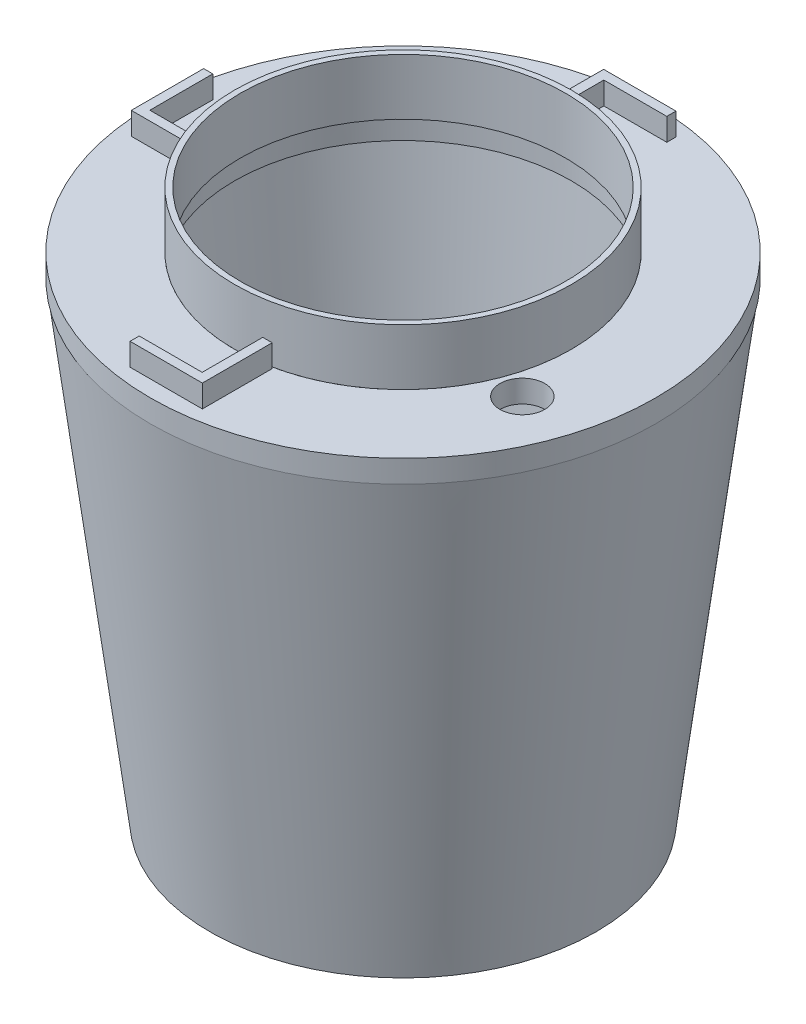
ISO-10303-21;
HEADER;
FILE_DESCRIPTION(('STEP AP214'),'2;1');
FILE_NAME('part.step','',(''),(''),'','','');
FILE_SCHEMA(('AUTOMOTIVE_DESIGN { 1 0 10303 214 1 1 1 1 }'));
ENDSEC;
DATA;
#1=APPLICATION_CONTEXT('core data for automotive mechanical design processes');
#2=APPLICATION_PROTOCOL_DEFINITION('international standard','automotive_design',2000,#1);
#3=PRODUCT_CONTEXT('',#1,'mechanical');
#4=PRODUCT('Part','Part','',(#3));
#5=PRODUCT_RELATED_PRODUCT_CATEGORY('part','',(#4));
#6=PRODUCT_DEFINITION_FORMATION('','',#4);
#7=PRODUCT_DEFINITION_CONTEXT('part definition',#1,'design');
#8=PRODUCT_DEFINITION('design','',#6,#7);
#9=PRODUCT_DEFINITION_SHAPE('','',#8);
#10=(LENGTH_UNIT() NAMED_UNIT(*) SI_UNIT(.MILLI.,.METRE.));
#11=(NAMED_UNIT(*) PLANE_ANGLE_UNIT() SI_UNIT($,.RADIAN.));
#12=(NAMED_UNIT(*) SI_UNIT($,.STERADIAN.) SOLID_ANGLE_UNIT());
#13=UNCERTAINTY_MEASURE_WITH_UNIT(LENGTH_MEASURE(1.E-05),#10,'distance_accuracy_value','');
#14=(GEOMETRIC_REPRESENTATION_CONTEXT(3) GLOBAL_UNCERTAINTY_ASSIGNED_CONTEXT((#13)) GLOBAL_UNIT_ASSIGNED_CONTEXT((#10,
#11,#12)) REPRESENTATION_CONTEXT('',''));
#15=CARTESIAN_POINT('',(0.,0.,0.));
#16=DIRECTION('',(0.,0.,1.));
#17=DIRECTION('',(1.,0.,0.));
#18=AXIS2_PLACEMENT_3D('',#15,#16,#17);
#19=CARTESIAN_POINT('',(8.81748666377419E-13,580.,0.));
#20=DIRECTION('',(0.,1.,0.));
#21=DIRECTION('',(-1.,0.,0.));
#22=AXIS2_PLACEMENT_3D('',#19,#20,#21);
#23=PLANE('',#22);
#24=CARTESIAN_POINT('',(8.81748666377419E-13,580.,0.));
#25=DIRECTION('',(0.,1.,0.));
#26=DIRECTION('',(-1.,0.,0.));
#27=AXIS2_PLACEMENT_3D('',#24,#25,#26);
#28=CIRCLE('',#27,300.);
#29=CARTESIAN_POINT('',(-299.999999999999,580.000000000002,0.));
#30=VERTEX_POINT('',#29);
#31=EDGE_CURVE('E11',#30,#30,#28,.T.);
#32=ORIENTED_EDGE('',*,*,#31,.T.);
#33=EDGE_LOOP('',(#32));
#34=FACE_BOUND('',#33,.T.);
#35=CARTESIAN_POINT('',(8.81748666377419E-13,580.,0.));
#36=DIRECTION('',(0.,1.,0.));
#37=DIRECTION('',(-1.,0.,0.));
#38=AXIS2_PLACEMENT_3D('',#35,#36,#37);
#39=CIRCLE('',#38,290.);
#40=CARTESIAN_POINT('',(-289.999999999999,580.000000000002,0.));
#41=VERTEX_POINT('',#40);
#42=EDGE_CURVE('E60',#41,#41,#39,.T.);
#43=ORIENTED_EDGE('',*,*,#42,.F.);
#44=EDGE_LOOP('',(#43));
#45=FACE_BOUND('',#44,.T.);
#46=ADVANCED_FACE('F49',(#34,#45),#23,.T.);
#47=CARTESIAN_POINT('',(1.83452398608792E-13,480.,0.));
#48=DIRECTION('',(0.,1.,0.));
#49=DIRECTION('',(-1.,0.,0.));
#50=AXIS2_PLACEMENT_3D('',#47,#48,#49);
#51=PLANE('',#50);
#52=CARTESIAN_POINT('',(1.83452398608792E-13,480.,0.));
#53=DIRECTION('',(0.,1.,0.));
#54=DIRECTION('',(-1.,0.,0.));
#55=AXIS2_PLACEMENT_3D('',#52,#53,#54);
#56=CIRCLE('',#55,300.);
#57=CARTESIAN_POINT('',(-300.,480.000000000002,0.));
#58=VERTEX_POINT('',#57);
#59=EDGE_CURVE('E53',#58,#58,#56,.T.);
#60=ORIENTED_EDGE('',*,*,#59,.F.);
#61=EDGE_LOOP('',(#60));
#62=FACE_BOUND('',#61,.T.);
#63=CARTESIAN_POINT('',(1.83452398608792E-13,480.,0.));
#64=DIRECTION('',(0.,1.,0.));
#65=DIRECTION('',(-1.,0.,0.));
#66=AXIS2_PLACEMENT_3D('',#63,#64,#65);
#67=CIRCLE('',#66,290.);
#68=CARTESIAN_POINT('',(-290.,480.000000000002,0.));
#69=VERTEX_POINT('',#68);
#70=EDGE_CURVE('E62',#69,#69,#67,.T.);
#71=ORIENTED_EDGE('',*,*,#70,.T.);
#72=EDGE_LOOP('',(#71));
#73=FACE_BOUND('',#72,.T.);
#74=ADVANCED_FACE('F72',(#62,#73),#51,.F.);
#75=CARTESIAN_POINT('',(8.81748666377419E-13,580.,0.));
#76=DIRECTION('',(0.,-1.,0.));
#77=DIRECTION('',(1.,0.,0.));
#78=AXIS2_PLACEMENT_3D('',#75,#76,#77);
#79=CYLINDRICAL_SURFACE('',#78,300.);
#80=ORIENTED_EDGE('',*,*,#31,.F.);
#81=EDGE_LOOP('',(#80));
#82=FACE_BOUND('',#81,.T.);
#83=ORIENTED_EDGE('',*,*,#59,.T.);
#84=EDGE_LOOP('',(#83));
#85=FACE_BOUND('',#84,.T.);
#86=ADVANCED_FACE('F51',(#82,#85),#79,.T.);
#87=CARTESIAN_POINT('',(8.81748666377419E-13,580.,0.));
#88=DIRECTION('',(0.,-1.,0.));
#89=DIRECTION('',(1.,0.,0.));
#90=AXIS2_PLACEMENT_3D('',#87,#88,#89);
#91=CYLINDRICAL_SURFACE('',#90,290.);
#92=ORIENTED_EDGE('',*,*,#42,.T.);
#93=EDGE_LOOP('',(#92));
#94=FACE_BOUND('',#93,.T.);
#95=ORIENTED_EDGE('',*,*,#70,.F.);
#96=EDGE_LOOP('',(#95));
#97=FACE_BOUND('',#96,.T.);
#98=ADVANCED_FACE('F68',(#94,#97),#91,.F.);
#99=CLOSED_SHELL('',(#46,#74,#86,#98));
#100=MANIFOLD_SOLID_BREP('B2',#99);
#101=CARTESIAN_POINT('',(1.83452398608792E-13,480.,0.));
#102=DIRECTION('',(0.,-1.,0.));
#103=DIRECTION('',(1.,0.,0.));
#104=AXIS2_PLACEMENT_3D('',#101,#102,#103);
#105=PLANE('',#104);
#106=CARTESIAN_POINT('',(1.83452398608792E-13,480.,0.));
#107=DIRECTION('',(0.,-1.,0.));
#108=DIRECTION('',(1.,0.,0.));
#109=AXIS2_PLACEMENT_3D('',#106,#107,#108);
#110=CIRCLE('',#109,449.9135991914);
#111=CARTESIAN_POINT('',(449.9135991914,479.999999999997,0.));
#112=VERTEX_POINT('',#111);
#113=EDGE_CURVE('E437',#112,#112,#110,.T.);
#114=ORIENTED_EDGE('',*,*,#113,.F.);
#115=EDGE_LOOP('',(#114));
#116=FACE_BOUND('',#115,.T.);
#117=CARTESIAN_POINT('',(329.,479.999999999998,116.390796003985));
#118=DIRECTION('',(0.,-1.,0.));
#119=DIRECTION('',(1.,0.,0.));
#120=AXIS2_PLACEMENT_3D('',#117,#118,#119);
#121=CIRCLE('',#120,40.);
#122=CARTESIAN_POINT('',(369.,479.999999999997,116.390796003985));
#123=VERTEX_POINT('',#122);
#124=EDGE_CURVE('E418',#123,#123,#121,.F.);
#125=ORIENTED_EDGE('',*,*,#124,.F.);
#126=EDGE_LOOP('',(#125));
#127=FACE_BOUND('',#126,.T.);
#128=DIRECTION('',(1.,0.,0.));
#129=VECTOR('',#128,1.);
#130=CARTESIAN_POINT('',(-65.5608926281112,480.,420.64042064597));
#131=LINE('',#130,#129);
#132=CARTESIAN_POINT('',(-65.5608926281112,480.,420.64042064597));
#133=VERTEX_POINT('',#132);
#134=CARTESIAN_POINT('',(63.3002574758802,480.,420.64042064597));
#135=VERTEX_POINT('',#134);
#136=EDGE_CURVE('E272',#133,#135,#131,.T.);
#137=ORIENTED_EDGE('',*,*,#136,.F.);
#138=DIRECTION('',(0.,0.,1.));
#139=VECTOR('',#138,1.);
#140=CARTESIAN_POINT('',(-65.5608926281112,480.,420.64042064597));
#141=LINE('',#140,#139);
#142=CARTESIAN_POINT('',(-65.5608926281112,480.,404.304870329621));
#143=VERTEX_POINT('',#142);
#144=EDGE_CURVE('E269',#143,#133,#141,.T.);
#145=ORIENTED_EDGE('',*,*,#144,.F.);
#146=DIRECTION('',(-1.,0.,0.));
#147=VECTOR('',#146,1.);
#148=CARTESIAN_POINT('',(-65.5608926281112,480.,404.304870329621));
#149=LINE('',#148,#147);
#150=CARTESIAN_POINT('',(46.5935386275027,480.,404.304870329621));
#151=VERTEX_POINT('',#150);
#152=EDGE_CURVE('E828',#151,#143,#149,.T.);
#153=ORIENTED_EDGE('',*,*,#152,.F.);
#154=DIRECTION('',(0.,0.,1.));
#155=VECTOR('',#154,1.);
#156=CARTESIAN_POINT('',(46.5935386275024,480.,299.999999999984));
#157=LINE('',#156,#155);
#158=CARTESIAN_POINT('',(46.5935386275024,480.,296.359650016947));
#159=VERTEX_POINT('',#158);
#160=EDGE_CURVE('E848',#159,#151,#157,.T.);
#161=ORIENTED_EDGE('',*,*,#160,.F.);
#162=CARTESIAN_POINT('',(1.83452398608792E-13,480.,0.));
#163=DIRECTION('',(0.,-1.,0.));
#164=DIRECTION('',(1.,0.,0.));
#165=AXIS2_PLACEMENT_3D('',#162,#163,#164);
#166=CIRCLE('',#165,300.);
#167=CARTESIAN_POINT('',(-296.359650016952,480.000000000002,46.5935386274721));
#168=VERTEX_POINT('',#167);
#169=EDGE_CURVE('E433',#159,#168,#166,.T.);
#170=ORIENTED_EDGE('',*,*,#169,.T.);
#171=DIRECTION('',(0.,0.,-1.));
#172=VECTOR('',#171,1.);
#173=CARTESIAN_POINT('',(-296.359650016952,480.000000000002,46.593538627472));
#174=LINE('',#173,#172);
#175=CARTESIAN_POINT('',(-296.359650016952,480.000000000002,63.3002574758497));
#176=VERTEX_POINT('',#175);
#177=EDGE_CURVE('E380',#176,#168,#174,.T.);
#178=ORIENTED_EDGE('',*,*,#177,.F.);
#179=DIRECTION('',(1.,0.,0.));
#180=VECTOR('',#179,1.);
#181=CARTESIAN_POINT('',(-296.359650016952,480.000000000002,63.3002574758497));
#182=LINE('',#181,#180);
#183=CARTESIAN_POINT('',(-420.640420645986,480.000000000003,63.3002574758497));
#184=VERTEX_POINT('',#183);
#185=EDGE_CURVE('E376',#184,#176,#182,.T.);
#186=ORIENTED_EDGE('',*,*,#185,.F.);
#187=DIRECTION('',(0.,0.,1.));
#188=VECTOR('',#187,1.);
#189=CARTESIAN_POINT('',(-420.640420645986,480.000000000003,-65.5608926281417));
#190=LINE('',#189,#188);
#191=CARTESIAN_POINT('',(-420.640420645986,480.000000000003,-65.5608926281417));
#192=VERTEX_POINT('',#191);
#193=EDGE_CURVE('E372',#192,#184,#190,.T.);
#194=ORIENTED_EDGE('',*,*,#193,.F.);
#195=DIRECTION('',(-1.,0.,0.));
#196=VECTOR('',#195,1.);
#197=CARTESIAN_POINT('',(-420.640420645986,480.000000000003,-65.5608926281417));
#198=LINE('',#197,#196);
#199=CARTESIAN_POINT('',(-404.304870329637,480.000000000003,-65.5608926281417));
#200=VERTEX_POINT('',#199);
#201=EDGE_CURVE('E347',#200,#192,#198,.T.);
#202=ORIENTED_EDGE('',*,*,#201,.F.);
#203=DIRECTION('',(0.,0.,-1.));
#204=VECTOR('',#203,1.);
#205=CARTESIAN_POINT('',(-404.304870329637,480.000000000003,-65.5608926281417));
#206=LINE('',#205,#204);
#207=CARTESIAN_POINT('',(-404.304870329637,480.000000000003,46.593538627472));
#208=VERTEX_POINT('',#207);
#209=EDGE_CURVE('E353',#208,#200,#206,.T.);
#210=ORIENTED_EDGE('',*,*,#209,.F.);
#211=DIRECTION('',(-1.,0.,0.));
#212=VECTOR('',#211,1.);
#213=CARTESIAN_POINT('',(-300.,480.000000000002,46.593538627472));
#214=LINE('',#213,#212);
#215=EDGE_CURVE('E384',#168,#208,#214,.T.);
#216=ORIENTED_EDGE('',*,*,#215,.F.);
#217=CARTESIAN_POINT('',(-46.5935386272798,480.,-296.359650016982));
#218=VERTEX_POINT('',#217);
#219=EDGE_CURVE('E427',#168,#218,#166,.T.);
#220=ORIENTED_EDGE('',*,*,#219,.T.);
#221=DIRECTION('',(1.,0.,0.));
#222=VECTOR('',#221,1.);
#223=CARTESIAN_POINT('',(-46.5935386274875,480.,-296.359650016982));
#224=LINE('',#223,#222);
#225=CARTESIAN_POINT('',(-63.3002574758652,480.,-296.359650016982));
#226=VERTEX_POINT('',#225);
#227=EDGE_CURVE('E309',#226,#218,#224,.T.);
#228=ORIENTED_EDGE('',*,*,#227,.F.);
#229=DIRECTION('',(0.,0.,1.));
#230=VECTOR('',#229,1.);
#231=CARTESIAN_POINT('',(-63.3002574758652,480.,-300.00000000003));
#232=LINE('',#231,#230);
#233=CARTESIAN_POINT('',(-63.3002574758652,480.,-420.640420646016));
#234=VERTEX_POINT('',#233);
#235=EDGE_CURVE('E279',#234,#226,#232,.T.);
#236=ORIENTED_EDGE('',*,*,#235,.F.);
#237=DIRECTION('',(-1.,0.,0.));
#238=VECTOR('',#237,1.);
#239=CARTESIAN_POINT('',(65.5608926281262,480.,-420.640420646016));
#240=LINE('',#239,#238);
#241=CARTESIAN_POINT('',(65.5608926281262,480.,-420.640420646016));
#242=VERTEX_POINT('',#241);
#243=EDGE_CURVE('E274',#242,#234,#240,.T.);
#244=ORIENTED_EDGE('',*,*,#243,.F.);
#245=DIRECTION('',(0.,0.,-1.));
#246=VECTOR('',#245,1.);
#247=CARTESIAN_POINT('',(65.5608926281262,480.,-420.640420646016));
#248=LINE('',#247,#246);
#249=CARTESIAN_POINT('',(65.5608926281262,480.,-404.304870329667));
#250=VERTEX_POINT('',#249);
#251=EDGE_CURVE('E290',#250,#242,#248,.T.);
#252=ORIENTED_EDGE('',*,*,#251,.F.);
#253=DIRECTION('',(1.,0.,0.));
#254=VECTOR('',#253,1.);
#255=CARTESIAN_POINT('',(65.5608926281262,480.,-404.304870329667));
#256=LINE('',#255,#254);
#257=CARTESIAN_POINT('',(-46.5935386274875,480.,-404.304870329667));
#258=VERTEX_POINT('',#257);
#259=EDGE_CURVE('E317',#258,#250,#256,.T.);
#260=ORIENTED_EDGE('',*,*,#259,.F.);
#261=DIRECTION('',(0.,0.,-1.));
#262=VECTOR('',#261,1.);
#263=CARTESIAN_POINT('',(-46.5935386274875,480.,-300.00000000003));
#264=LINE('',#263,#262);
#265=EDGE_CURVE('E313',#218,#258,#264,.T.);
#266=ORIENTED_EDGE('',*,*,#265,.F.);
#267=EDGE_CURVE('E432',#218,#159,#166,.T.);
#268=ORIENTED_EDGE('',*,*,#267,.T.);
#269=DIRECTION('',(-1.,0.,0.));
#270=VECTOR('',#269,1.);
#271=CARTESIAN_POINT('',(46.5935386275024,480.,296.359650016936));
#272=LINE('',#271,#270);
#273=CARTESIAN_POINT('',(63.3002574758805,480.,296.359650016936));
#274=VERTEX_POINT('',#273);
#275=EDGE_CURVE('E138',#274,#159,#272,.T.);
#276=ORIENTED_EDGE('',*,*,#275,.F.);
#277=DIRECTION('',(0.,0.,-1.));
#278=VECTOR('',#277,1.);
#279=CARTESIAN_POINT('',(63.3002574758802,480.,299.999999999984));
#280=LINE('',#279,#278);
#281=EDGE_CURVE('E133',#135,#274,#280,.T.);
#282=ORIENTED_EDGE('',*,*,#281,.F.);
#283=EDGE_LOOP('',(#137,#145,#153,#161,#170,#178,#186,#194,#202,#210,#216,#220,#228,#236,#244,
#252,#260,#266,#268,#276,#282));
#284=FACE_BOUND('',#283,.T.);
#285=ADVANCED_FACE('F111',(#116,#127,#284),#105,.F.);
#286=CARTESIAN_POINT('',(0.,453.634978952027,0.));
#287=DIRECTION('',(0.,1.,0.));
#288=DIRECTION('',(-1.,0.,0.));
#289=AXIS2_PLACEMENT_3D('',#286,#287,#288);
#290=CONICAL_SURFACE('',#289,400.000001225462,0.124354996055023);
#291=CARTESIAN_POINT('',(1.57129351479355E-13,440.,0.));
#292=DIRECTION('',(0.,-1.,0.));
#293=DIRECTION('',(1.,0.,0.));
#294=AXIS2_PLACEMENT_3D('',#291,#292,#293);
#295=CIRCLE('',#294,398.295628835572);
#296=CARTESIAN_POINT('',(398.295628835573,439.999999999997,0.));
#297=VERTEX_POINT('',#296);
#298=EDGE_CURVE('E449',#297,#297,#295,.T.);
#299=ORIENTED_EDGE('',*,*,#298,.F.);
#300=EDGE_LOOP('',(#299));
#301=FACE_BOUND('',#300,.T.);
#302=CARTESIAN_POINT('',(0.,-346.365021047973,0.));
#303=DIRECTION('',(0.,-1.,0.));
#304=DIRECTION('',(1.,0.,0.));
#305=AXIS2_PLACEMENT_3D('',#302,#303,#304);
#306=CIRCLE('',#305,300.);
#307=CARTESIAN_POINT('',(300.,-346.365021047973,0.));
#308=VERTEX_POINT('',#307);
#309=EDGE_CURVE('E441',#308,#308,#306,.T.);
#310=ORIENTED_EDGE('',*,*,#309,.T.);
#311=EDGE_LOOP('',(#310));
#312=FACE_BOUND('',#311,.T.);
#313=CARTESIAN_POINT('',(-8.99081232531317E-13,365.,0.));
#314=DIRECTION('',(0.,-1.,0.));
#315=DIRECTION('',(1.,0.,0.));
#316=AXIS2_PLACEMENT_3D('',#313,#314,#315);
#317=CIRCLE('',#316,388.920628720685);
#318=CARTESIAN_POINT('',(367.420414157752,364.999999999997,127.520565810534));
#319=VERTEX_POINT('',#318);
#320=CARTESIAN_POINT('',(365.872035568714,364.999999999997,131.897342783312));
#321=VERTEX_POINT('',#320);
#322=EDGE_CURVE('E126',#319,#321,#317,.T.);
#323=ORIENTED_EDGE('',*,*,#322,.F.);
#324=CARTESIAN_POINT('',(367.420547725301,364.999799999997,127.520104719614));
#325=CARTESIAN_POINT('',(367.377451100847,365.064380780821,127.668899908256));
#326=CARTESIAN_POINT('',(367.332816942867,365.123435836757,127.819734004511));
#327=CARTESIAN_POINT('',(367.240503232415,365.229314914026,128.124902648682));
#328=CARTESIAN_POINT('',(367.192820570378,365.276126190402,128.279240663814));
#329=CARTESIAN_POINT('',(367.094644324463,365.356105291162,128.590163618304));
#330=CARTESIAN_POINT('',(367.044157586223,365.389304815828,128.746742447927));
#331=CARTESIAN_POINT('',(366.940553698356,365.44127603721,129.061308577041));
#332=CARTESIAN_POINT('',(366.88743763193,365.460053623523,129.219295274898));
#333=CARTESIAN_POINT('',(366.723942381428,365.493825477043,129.695552884951));
#334=CARTESIAN_POINT('',(366.609918293707,365.485837618788,130.014525935467));
#335=CARTESIAN_POINT('',(366.376474992325,365.409527596015,130.642518021559));
#336=CARTESIAN_POINT('',(366.257061158599,365.341264386375,130.951546477838));
#337=CARTESIAN_POINT('',(366.092862439022,365.212496335922,131.361895202446));
#338=CARTESIAN_POINT('',(366.048642293268,365.174388616228,131.470973402926));
#339=CARTESIAN_POINT('',(365.960225074659,365.091770996076,131.686391043563));
#340=CARTESIAN_POINT('',(365.916028148054,365.0472746958,131.792735749754));
#341=CARTESIAN_POINT('',(365.871849469275,364.999799999997,131.897785289951));
#342=B_SPLINE_CURVE_WITH_KNOTS('',3,(#324,#325,#326,#327,#328,#329,#330,#331,#332,#333,#334,
#335,#336,#337,#338,#339,#340,#341),.UNSPECIFIED.,.F.,.F.,(4,2,2,2,2,2,2,2,4),(0.,
0.503502056321572,1.00752615738576,1.51036968099835,2.01300774525483,3.0233820337639,
4.03276917596355,4.40378104023876,4.77401448362806),.UNSPECIFIED.);
#343=EDGE_CURVE('E47',#319,#321,#342,.T.);
#344=ORIENTED_EDGE('',*,*,#343,.T.);
#345=EDGE_LOOP('',(#323,#344));
#346=FACE_BOUND('',#345,.T.);
#347=ADVANCED_FACE('F467',(#301,#312,#346),#290,.F.);
#348=CARTESIAN_POINT('',(344.139110926866,-396.365021123973,0.));
#349=DIRECTION('',(0.,-1.,0.));
#350=DIRECTION('',(1.,0.,0.));
#351=AXIS2_PLACEMENT_3D('',#348,#349,#350);
#352=PLANE('',#351);
#353=CARTESIAN_POINT('',(0.,-396.365021123973,0.));
#354=DIRECTION('',(0.,-1.,0.));
#355=DIRECTION('',(1.,0.,0.));
#356=AXIS2_PLACEMENT_3D('',#353,#354,#355);
#357=CIRCLE('',#356,344.139110926866);
#358=CARTESIAN_POINT('',(344.139110926866,-396.365021123973,0.));
#359=VERTEX_POINT('',#358);
#360=EDGE_CURVE('E453',#359,#359,#357,.T.);
#361=ORIENTED_EDGE('',*,*,#360,.T.);
#362=EDGE_LOOP('',(#361));
#363=FACE_BOUND('',#362,.T.);
#364=ADVANCED_FACE('F469',(#363),#352,.T.);
#365=CARTESIAN_POINT('',(0.,-396.365021123973,0.));
#366=DIRECTION('',(0.,1.,0.));
#367=DIRECTION('',(-1.,0.,0.));
#368=AXIS2_PLACEMENT_3D('',#365,#366,#367);
#369=CONICAL_SURFACE('',#368,344.139110926866,0.124354996055023);
#370=CARTESIAN_POINT('',(1.20852091476542E-11,440.,0.));
#371=DIRECTION('',(0.,-1.,0.));
#372=DIRECTION('',(1.,0.,0.));
#373=AXIS2_PLACEMENT_3D('',#370,#371,#372);
#374=CIRCLE('',#373,448.68473984853);
#375=CARTESIAN_POINT('',(448.684739848542,439.999999999997,0.));
#376=VERTEX_POINT('',#375);
#377=EDGE_CURVE('E445',#376,#376,#374,.F.);
#378=ORIENTED_EDGE('',*,*,#377,.F.);
#379=EDGE_LOOP('',(#378));
#380=FACE_BOUND('',#379,.T.);
#381=ORIENTED_EDGE('',*,*,#360,.F.);
#382=EDGE_LOOP('',(#381));
#383=FACE_BOUND('',#382,.T.);
#384=ADVANCED_FACE('F475',(#380,#383),#369,.T.);
#385=CARTESIAN_POINT('',(0.,440.,0.));
#386=DIRECTION('',(0.,-1.,0.));
#387=DIRECTION('',(1.,0.,0.));
#388=AXIS2_PLACEMENT_3D('',#385,#386,#387);
#389=PLANE('',#388);
#390=CARTESIAN_POINT('',(0.,440.,0.));
#391=DIRECTION('',(0.,-1.,0.));
#392=DIRECTION('',(1.,0.,0.));
#393=AXIS2_PLACEMENT_3D('',#390,#391,#392);
#394=CIRCLE('',#393,449.9135991914);
#395=CARTESIAN_POINT('',(449.913599191399,439.999999999997,0.));
#396=VERTEX_POINT('',#395);
#397=EDGE_CURVE('E431',#396,#396,#394,.T.);
#398=ORIENTED_EDGE('',*,*,#397,.T.);
#399=EDGE_LOOP('',(#398));
#400=FACE_BOUND('',#399,.T.);
#401=ORIENTED_EDGE('',*,*,#377,.T.);
#402=EDGE_LOOP('',(#401));
#403=FACE_BOUND('',#402,.T.);
#404=ADVANCED_FACE('F487',(#400,#403),#389,.T.);
#405=CARTESIAN_POINT('',(329.,439.999999999998,116.390796003985));
#406=DIRECTION('',(0.,-1.,0.));
#407=DIRECTION('',(1.,0.,0.));
#408=AXIS2_PLACEMENT_3D('',#405,#406,#407);
#409=CIRCLE('',#408,40.);
#410=CARTESIAN_POINT('',(369.,439.999999999997,116.390796003985));
#411=VERTEX_POINT('',#410);
#412=EDGE_CURVE('E422',#411,#411,#409,.F.);
#413=ORIENTED_EDGE('',*,*,#412,.T.);
#414=EDGE_LOOP('',(#413));
#415=FACE_BOUND('',#414,.T.);
#416=CARTESIAN_POINT('',(0.,440.,0.));
#417=DIRECTION('',(0.,-1.,0.));
#418=DIRECTION('',(1.,0.,0.));
#419=AXIS2_PLACEMENT_3D('',#416,#417,#418);
#420=CIRCLE('',#419,300.);
#421=CARTESIAN_POINT('',(300.,439.999999999998,0.));
#422=VERTEX_POINT('',#421);
#423=EDGE_CURVE('E426',#422,#422,#420,.T.);
#424=ORIENTED_EDGE('',*,*,#423,.F.);
#425=EDGE_LOOP('',(#424));
#426=FACE_BOUND('',#425,.T.);
#427=ORIENTED_EDGE('',*,*,#298,.T.);
#428=EDGE_LOOP('',(#427));
#429=FACE_BOUND('',#428,.T.);
#430=ADVANCED_FACE('F492',(#415,#426,#429),#389,.T.);
#431=CARTESIAN_POINT('',(1.83452398608792E-13,480.,0.));
#432=DIRECTION('',(0.,-1.,0.));
#433=DIRECTION('',(1.,0.,0.));
#434=AXIS2_PLACEMENT_3D('',#431,#432,#433);
#435=CYLINDRICAL_SURFACE('',#434,449.9135991914);
#436=ORIENTED_EDGE('',*,*,#113,.T.);
#437=EDGE_LOOP('',(#436));
#438=FACE_BOUND('',#437,.T.);
#439=ORIENTED_EDGE('',*,*,#397,.F.);
#440=EDGE_LOOP('',(#439));
#441=FACE_BOUND('',#440,.T.);
#442=ADVANCED_FACE('F484',(#438,#441),#435,.T.);
#443=CARTESIAN_POINT('',(1.83452398608792E-13,480.,0.));
#444=DIRECTION('',(0.,-1.,0.));
#445=DIRECTION('',(1.,0.,0.));
#446=AXIS2_PLACEMENT_3D('',#443,#444,#445);
#447=CYLINDRICAL_SURFACE('',#446,300.);
#448=ORIENTED_EDGE('',*,*,#219,.F.);
#449=ORIENTED_EDGE('',*,*,#169,.F.);
#450=ORIENTED_EDGE('',*,*,#267,.F.);
#451=EDGE_LOOP('',(#448,#449,#450));
#452=FACE_BOUND('',#451,.T.);
#453=ORIENTED_EDGE('',*,*,#423,.T.);
#454=EDGE_LOOP('',(#453));
#455=FACE_BOUND('',#454,.T.);
#456=ADVANCED_FACE('F503',(#452,#455),#447,.F.);
#457=CARTESIAN_POINT('',(300.,-346.365021047973,0.));
#458=DIRECTION('',(0.,1.,0.));
#459=DIRECTION('',(-1.,0.,0.));
#460=AXIS2_PLACEMENT_3D('',#457,#458,#459);
#461=PLANE('',#460);
#462=ORIENTED_EDGE('',*,*,#309,.F.);
#463=EDGE_LOOP('',(#462));
#464=FACE_BOUND('',#463,.T.);
#465=ADVANCED_FACE('F113',(#464),#461,.T.);
#466=CARTESIAN_POINT('',(328.999999999999,364.999999999998,116.390796003985));
#467=DIRECTION('',(0.,-1.,0.));
#468=DIRECTION('',(1.,0.,0.));
#469=AXIS2_PLACEMENT_3D('',#466,#467,#468);
#470=PLANE('',#469);
#471=ORIENTED_EDGE('',*,*,#322,.T.);
#472=CARTESIAN_POINT('',(328.999999999999,364.999999999998,116.390796003985));
#473=DIRECTION('',(0.,-1.,0.));
#474=DIRECTION('',(1.,0.,0.));
#475=AXIS2_PLACEMENT_3D('',#472,#473,#474);
#476=CIRCLE('',#475,40.);
#477=EDGE_CURVE('E414',#319,#321,#476,.T.);
#478=ORIENTED_EDGE('',*,*,#477,.F.);
#479=EDGE_LOOP('',(#471,#478));
#480=FACE_BOUND('',#479,.T.);
#481=ADVANCED_FACE('F462',(#480),#470,.F.);
#482=CARTESIAN_POINT('',(328.999999999999,364.999999999998,116.390796003985));
#483=DIRECTION('',(0.,1.,0.));
#484=DIRECTION('',(-1.,0.,0.));
#485=AXIS2_PLACEMENT_3D('',#482,#483,#484);
#486=CYLINDRICAL_SURFACE('',#485,40.);
#487=ORIENTED_EDGE('',*,*,#477,.T.);
#488=ORIENTED_EDGE('',*,*,#343,.F.);
#489=EDGE_LOOP('',(#487,#488));
#490=FACE_BOUND('',#489,.T.);
#491=ADVANCED_FACE('F466',(#490),#486,.F.);
#492=ORIENTED_EDGE('',*,*,#412,.F.);
#493=EDGE_LOOP('',(#492));
#494=FACE_BOUND('',#493,.T.);
#495=ORIENTED_EDGE('',*,*,#124,.T.);
#496=EDGE_LOOP('',(#495));
#497=FACE_BOUND('',#496,.T.);
#498=ADVANCED_FACE('F509',(#494,#497),#486,.F.);
#499=CARTESIAN_POINT('',(-420.640420645985,520.000000000003,-65.5608926281417));
#500=DIRECTION('',(0.,0.,1.));
#501=DIRECTION('',(1.,0.,0.));
#502=AXIS2_PLACEMENT_3D('',#499,#500,#501);
#503=PLANE('',#502);
#504=ORIENTED_EDGE('',*,*,#201,.T.);
#505=DIRECTION('',(0.,-1.,0.));
#506=VECTOR('',#505,1.);
#507=CARTESIAN_POINT('',(-420.640420645985,520.000000000003,-65.5608926281417));
#508=LINE('',#507,#506);
#509=CARTESIAN_POINT('',(-420.640420645985,520.000000000003,-65.5608926281417));
#510=VERTEX_POINT('',#509);
#511=EDGE_CURVE('E410',#510,#192,#508,.T.);
#512=ORIENTED_EDGE('',*,*,#511,.F.);
#513=DIRECTION('',(-1.,0.,0.));
#514=VECTOR('',#513,1.);
#515=CARTESIAN_POINT('',(-420.640420645985,520.000000000003,-65.5608926281417));
#516=LINE('',#515,#514);
#517=CARTESIAN_POINT('',(-404.304870329636,520.000000000003,-65.5608926281417));
#518=VERTEX_POINT('',#517);
#519=EDGE_CURVE('E348',#518,#510,#516,.T.);
#520=ORIENTED_EDGE('',*,*,#519,.F.);
#521=DIRECTION('',(0.,-1.,0.));
#522=VECTOR('',#521,1.);
#523=CARTESIAN_POINT('',(-404.304870329636,520.000000000003,-65.5608926281417));
#524=LINE('',#523,#522);
#525=EDGE_CURVE('E368',#518,#200,#524,.T.);
#526=ORIENTED_EDGE('',*,*,#525,.T.);
#527=EDGE_LOOP('',(#504,#512,#520,#526));
#528=FACE_BOUND('',#527,.T.);
#529=ADVANCED_FACE('F512',(#528),#503,.F.);
#530=CARTESIAN_POINT('',(-420.640420645985,520.000000000003,-65.5608926281417));
#531=DIRECTION('',(1.,0.,0.));
#532=DIRECTION('',(0.,1.,0.));
#533=AXIS2_PLACEMENT_3D('',#530,#531,#532);
#534=PLANE('',#533);
#535=ORIENTED_EDGE('',*,*,#193,.T.);
#536=DIRECTION('',(0.,-1.,0.));
#537=VECTOR('',#536,1.);
#538=CARTESIAN_POINT('',(-420.640420645985,520.000000000003,63.3002574758497));
#539=LINE('',#538,#537);
#540=CARTESIAN_POINT('',(-420.640420645985,520.000000000003,63.3002574758497));
#541=VERTEX_POINT('',#540);
#542=EDGE_CURVE('E406',#541,#184,#539,.T.);
#543=ORIENTED_EDGE('',*,*,#542,.F.);
#544=DIRECTION('',(0.,0.,1.));
#545=VECTOR('',#544,1.);
#546=CARTESIAN_POINT('',(-420.640420645985,520.000000000003,-65.5608926281417));
#547=LINE('',#546,#545);
#548=EDGE_CURVE('E352',#510,#541,#547,.T.);
#549=ORIENTED_EDGE('',*,*,#548,.F.);
#550=ORIENTED_EDGE('',*,*,#511,.T.);
#551=EDGE_LOOP('',(#535,#543,#549,#550));
#552=FACE_BOUND('',#551,.T.);
#553=ADVANCED_FACE('F515',(#552),#534,.F.);
#554=CARTESIAN_POINT('',(-296.359650016952,520.000000000002,63.3002574758497));
#555=DIRECTION('',(0.,0.,-1.));
#556=DIRECTION('',(-1.,0.,0.));
#557=AXIS2_PLACEMENT_3D('',#554,#555,#556);
#558=PLANE('',#557);
#559=ORIENTED_EDGE('',*,*,#185,.T.);
#560=DIRECTION('',(0.,-1.,0.));
#561=VECTOR('',#560,1.);
#562=CARTESIAN_POINT('',(-296.359650016952,520.000000000002,63.3002574758497));
#563=LINE('',#562,#561);
#564=CARTESIAN_POINT('',(-296.359650016952,520.000000000002,63.3002574758497));
#565=VERTEX_POINT('',#564);
#566=EDGE_CURVE('E402',#565,#176,#563,.T.);
#567=ORIENTED_EDGE('',*,*,#566,.F.);
#568=DIRECTION('',(1.,0.,0.));
#569=VECTOR('',#568,1.);
#570=CARTESIAN_POINT('',(-404.304870329636,520.000000000003,63.3002574758497));
#571=LINE('',#570,#569);
#572=EDGE_CURVE('E356',#541,#565,#571,.T.);
#573=ORIENTED_EDGE('',*,*,#572,.F.);
#574=ORIENTED_EDGE('',*,*,#542,.T.);
#575=EDGE_LOOP('',(#559,#567,#573,#574));
#576=FACE_BOUND('',#575,.T.);
#577=ADVANCED_FACE('F519',(#576),#558,.F.);
#578=CARTESIAN_POINT('',(-296.359650016952,520.000000000002,46.593538627472));
#579=DIRECTION('',(-1.,0.,0.));
#580=DIRECTION('',(0.,-1.,0.));
#581=AXIS2_PLACEMENT_3D('',#578,#579,#580);
#582=PLANE('',#581);
#583=ORIENTED_EDGE('',*,*,#177,.T.);
#584=DIRECTION('',(0.,-1.,0.));
#585=VECTOR('',#584,1.);
#586=CARTESIAN_POINT('',(-296.359650016952,520.000000000002,46.593538627472));
#587=LINE('',#586,#585);
#588=CARTESIAN_POINT('',(-296.359650016952,520.000000000002,46.593538627472));
#589=VERTEX_POINT('',#588);
#590=EDGE_CURVE('E398',#589,#168,#587,.T.);
#591=ORIENTED_EDGE('',*,*,#590,.F.);
#592=DIRECTION('',(0.,0.,-1.));
#593=VECTOR('',#592,1.);
#594=CARTESIAN_POINT('',(-296.359650016952,520.000000000002,46.593538627472));
#595=LINE('',#594,#593);
#596=EDGE_CURVE('E359',#565,#589,#595,.T.);
#597=ORIENTED_EDGE('',*,*,#596,.F.);
#598=ORIENTED_EDGE('',*,*,#566,.T.);
#599=EDGE_LOOP('',(#583,#591,#597,#598));
#600=FACE_BOUND('',#599,.T.);
#601=ADVANCED_FACE('F523',(#600),#582,.F.);
#602=CARTESIAN_POINT('',(-300.,520.000000000002,46.593538627472));
#603=DIRECTION('',(0.,0.,1.));
#604=DIRECTION('',(1.,0.,0.));
#605=AXIS2_PLACEMENT_3D('',#602,#603,#604);
#606=PLANE('',#605);
#607=ORIENTED_EDGE('',*,*,#215,.T.);
#608=DIRECTION('',(0.,-1.,0.));
#609=VECTOR('',#608,1.);
#610=CARTESIAN_POINT('',(-404.304870329636,520.000000000003,46.593538627472));
#611=LINE('',#610,#609);
#612=CARTESIAN_POINT('',(-404.304870329636,520.000000000003,46.593538627472));
#613=VERTEX_POINT('',#612);
#614=EDGE_CURVE('E394',#613,#208,#611,.T.);
#615=ORIENTED_EDGE('',*,*,#614,.F.);
#616=DIRECTION('',(-1.,0.,0.));
#617=VECTOR('',#616,1.);
#618=CARTESIAN_POINT('',(-300.,520.000000000002,46.593538627472));
#619=LINE('',#618,#617);
#620=EDGE_CURVE('E362',#589,#613,#619,.T.);
#621=ORIENTED_EDGE('',*,*,#620,.F.);
#622=ORIENTED_EDGE('',*,*,#590,.T.);
#623=EDGE_LOOP('',(#607,#615,#621,#622));
#624=FACE_BOUND('',#623,.T.);
#625=ADVANCED_FACE('F527',(#624),#606,.F.);
#626=CARTESIAN_POINT('',(-404.304870329636,520.000000000003,-65.5608926281417));
#627=DIRECTION('',(-1.,0.,0.));
#628=DIRECTION('',(0.,-1.,0.));
#629=AXIS2_PLACEMENT_3D('',#626,#627,#628);
#630=PLANE('',#629);
#631=ORIENTED_EDGE('',*,*,#209,.T.);
#632=ORIENTED_EDGE('',*,*,#525,.F.);
#633=DIRECTION('',(0.,0.,-1.));
#634=VECTOR('',#633,1.);
#635=CARTESIAN_POINT('',(-404.304870329636,520.000000000003,-65.5608926281417));
#636=LINE('',#635,#634);
#637=EDGE_CURVE('E365',#613,#518,#636,.T.);
#638=ORIENTED_EDGE('',*,*,#637,.F.);
#639=ORIENTED_EDGE('',*,*,#614,.T.);
#640=EDGE_LOOP('',(#631,#632,#638,#639));
#641=FACE_BOUND('',#640,.T.);
#642=ADVANCED_FACE('F531',(#641),#630,.F.);
#643=CARTESIAN_POINT('',(3.54157194516109E-12,520.,0.));
#644=DIRECTION('',(0.,-1.,0.));
#645=DIRECTION('',(1.,0.,0.));
#646=AXIS2_PLACEMENT_3D('',#643,#644,#645);
#647=PLANE('',#646);
#648=ORIENTED_EDGE('',*,*,#519,.T.);
#649=ORIENTED_EDGE('',*,*,#548,.T.);
#650=ORIENTED_EDGE('',*,*,#572,.T.);
#651=ORIENTED_EDGE('',*,*,#596,.T.);
#652=ORIENTED_EDGE('',*,*,#620,.T.);
#653=ORIENTED_EDGE('',*,*,#637,.T.);
#654=EDGE_LOOP('',(#648,#649,#650,#651,#652,#653));
#655=FACE_BOUND('',#654,.T.);
#656=ADVANCED_FACE('F535',(#655),#647,.F.);
#657=CARTESIAN_POINT('',(65.5608926281265,520.,-420.640420646016));
#658=DIRECTION('',(0.,0.,1.));
#659=DIRECTION('',(1.,0.,0.));
#660=AXIS2_PLACEMENT_3D('',#657,#658,#659);
#661=PLANE('',#660);
#662=ORIENTED_EDGE('',*,*,#243,.T.);
#663=DIRECTION('',(0.,-1.,0.));
#664=VECTOR('',#663,1.);
#665=CARTESIAN_POINT('',(-63.3002574758649,520.,-420.640420646016));
#666=LINE('',#665,#664);
#667=CARTESIAN_POINT('',(-63.3002574758649,520.,-420.640420646016));
#668=VERTEX_POINT('',#667);
#669=EDGE_CURVE('E343',#668,#234,#666,.T.);
#670=ORIENTED_EDGE('',*,*,#669,.F.);
#671=DIRECTION('',(-1.,0.,0.));
#672=VECTOR('',#671,1.);
#673=CARTESIAN_POINT('',(65.5608926281265,520.,-420.640420646016));
#674=LINE('',#673,#672);
#675=CARTESIAN_POINT('',(65.5608926281265,520.,-420.640420646016));
#676=VERTEX_POINT('',#675);
#677=EDGE_CURVE('E285',#676,#668,#674,.T.);
#678=ORIENTED_EDGE('',*,*,#677,.F.);
#679=DIRECTION('',(0.,-1.,0.));
#680=VECTOR('',#679,1.);
#681=CARTESIAN_POINT('',(65.5608926281265,520.,-420.640420646016));
#682=LINE('',#681,#680);
#683=EDGE_CURVE('E304',#676,#242,#682,.T.);
#684=ORIENTED_EDGE('',*,*,#683,.T.);
#685=EDGE_LOOP('',(#662,#670,#678,#684));
#686=FACE_BOUND('',#685,.T.);
#687=ADVANCED_FACE('F539',(#686),#661,.F.);
#688=CARTESIAN_POINT('',(-63.3002574758649,520.,-300.00000000003));
#689=DIRECTION('',(1.,0.,0.));
#690=DIRECTION('',(0.,1.,0.));
#691=AXIS2_PLACEMENT_3D('',#688,#689,#690);
#692=PLANE('',#691);
#693=ORIENTED_EDGE('',*,*,#235,.T.);
#694=DIRECTION('',(0.,-1.,0.));
#695=VECTOR('',#694,1.);
#696=CARTESIAN_POINT('',(-63.3002574758649,520.,-296.359650016982));
#697=LINE('',#696,#695);
#698=CARTESIAN_POINT('',(-63.3002574758649,520.,-296.359650016982));
#699=VERTEX_POINT('',#698);
#700=EDGE_CURVE('E339',#699,#226,#697,.T.);
#701=ORIENTED_EDGE('',*,*,#700,.F.);
#702=DIRECTION('',(0.,0.,1.));
#703=VECTOR('',#702,1.);
#704=CARTESIAN_POINT('',(-63.3002574758649,520.,-404.304870329667));
#705=LINE('',#704,#703);
#706=EDGE_CURVE('E289',#668,#699,#705,.T.);
#707=ORIENTED_EDGE('',*,*,#706,.F.);
#708=ORIENTED_EDGE('',*,*,#669,.T.);
#709=EDGE_LOOP('',(#693,#701,#707,#708));
#710=FACE_BOUND('',#709,.T.);
#711=ADVANCED_FACE('F543',(#710),#692,.F.);
#712=CARTESIAN_POINT('',(-46.5935386274872,520.,-296.359650016982));
#713=DIRECTION('',(0.,0.,-1.));
#714=DIRECTION('',(-1.,0.,0.));
#715=AXIS2_PLACEMENT_3D('',#712,#713,#714);
#716=PLANE('',#715);
#717=ORIENTED_EDGE('',*,*,#227,.T.);
#718=DIRECTION('',(0.,-1.,0.));
#719=VECTOR('',#718,1.);
#720=CARTESIAN_POINT('',(-46.5935386274872,520.,-296.359650016982));
#721=LINE('',#720,#719);
#722=CARTESIAN_POINT('',(-46.5935386274872,520.,-296.359650016982));
#723=VERTEX_POINT('',#722);
#724=EDGE_CURVE('E335',#723,#218,#721,.T.);
#725=ORIENTED_EDGE('',*,*,#724,.F.);
#726=DIRECTION('',(1.,0.,0.));
#727=VECTOR('',#726,1.);
#728=CARTESIAN_POINT('',(-46.5935386274872,520.,-296.359650016982));
#729=LINE('',#728,#727);
#730=EDGE_CURVE('E293',#699,#723,#729,.T.);
#731=ORIENTED_EDGE('',*,*,#730,.F.);
#732=ORIENTED_EDGE('',*,*,#700,.T.);
#733=EDGE_LOOP('',(#717,#725,#731,#732));
#734=FACE_BOUND('',#733,.T.);
#735=ADVANCED_FACE('F547',(#734),#716,.F.);
#736=CARTESIAN_POINT('',(-46.5935386274872,520.,-300.00000000003));
#737=DIRECTION('',(-1.,0.,0.));
#738=DIRECTION('',(0.,-1.,0.));
#739=AXIS2_PLACEMENT_3D('',#736,#737,#738);
#740=PLANE('',#739);
#741=ORIENTED_EDGE('',*,*,#265,.T.);
#742=DIRECTION('',(0.,-1.,0.));
#743=VECTOR('',#742,1.);
#744=CARTESIAN_POINT('',(-46.5935386274872,520.,-404.304870329667));
#745=LINE('',#744,#743);
#746=CARTESIAN_POINT('',(-46.5935386274872,520.,-404.304870329667));
#747=VERTEX_POINT('',#746);
#748=EDGE_CURVE('E331',#747,#258,#745,.T.);
#749=ORIENTED_EDGE('',*,*,#748,.F.);
#750=DIRECTION('',(0.,0.,-1.));
#751=VECTOR('',#750,1.);
#752=CARTESIAN_POINT('',(-46.5935386274872,520.,-300.00000000003));
#753=LINE('',#752,#751);
#754=EDGE_CURVE('E296',#723,#747,#753,.T.);
#755=ORIENTED_EDGE('',*,*,#754,.F.);
#756=ORIENTED_EDGE('',*,*,#724,.T.);
#757=EDGE_LOOP('',(#741,#749,#755,#756));
#758=FACE_BOUND('',#757,.T.);
#759=ADVANCED_FACE('F551',(#758),#740,.F.);
#760=CARTESIAN_POINT('',(65.5608926281265,520.,-404.304870329667));
#761=DIRECTION('',(0.,0.,-1.));
#762=DIRECTION('',(-1.,0.,0.));
#763=AXIS2_PLACEMENT_3D('',#760,#761,#762);
#764=PLANE('',#763);
#765=ORIENTED_EDGE('',*,*,#259,.T.);
#766=DIRECTION('',(0.,-1.,0.));
#767=VECTOR('',#766,1.);
#768=CARTESIAN_POINT('',(65.5608926281265,520.,-404.304870329667));
#769=LINE('',#768,#767);
#770=CARTESIAN_POINT('',(65.5608926281265,520.,-404.304870329667));
#771=VERTEX_POINT('',#770);
#772=EDGE_CURVE('E327',#771,#250,#769,.T.);
#773=ORIENTED_EDGE('',*,*,#772,.F.);
#774=DIRECTION('',(1.,0.,0.));
#775=VECTOR('',#774,1.);
#776=CARTESIAN_POINT('',(65.5608926281265,520.,-404.304870329667));
#777=LINE('',#776,#775);
#778=EDGE_CURVE('E299',#747,#771,#777,.T.);
#779=ORIENTED_EDGE('',*,*,#778,.F.);
#780=ORIENTED_EDGE('',*,*,#748,.T.);
#781=EDGE_LOOP('',(#765,#773,#779,#780));
#782=FACE_BOUND('',#781,.T.);
#783=ADVANCED_FACE('F555',(#782),#764,.F.);
#784=CARTESIAN_POINT('',(65.5608926281265,520.,-420.640420646016));
#785=DIRECTION('',(-1.,0.,0.));
#786=DIRECTION('',(0.,-1.,0.));
#787=AXIS2_PLACEMENT_3D('',#784,#785,#786);
#788=PLANE('',#787);
#789=ORIENTED_EDGE('',*,*,#251,.T.);
#790=ORIENTED_EDGE('',*,*,#683,.F.);
#791=DIRECTION('',(0.,0.,-1.));
#792=VECTOR('',#791,1.);
#793=CARTESIAN_POINT('',(65.5608926281265,520.,-420.640420646016));
#794=LINE('',#793,#792);
#795=EDGE_CURVE('E302',#771,#676,#794,.T.);
#796=ORIENTED_EDGE('',*,*,#795,.F.);
#797=ORIENTED_EDGE('',*,*,#772,.T.);
#798=EDGE_LOOP('',(#789,#790,#796,#797));
#799=FACE_BOUND('',#798,.T.);
#800=ADVANCED_FACE('F559',(#799),#788,.F.);
#801=CARTESIAN_POINT('',(3.58772946814585E-12,520.,0.));
#802=DIRECTION('',(0.,-1.,0.));
#803=DIRECTION('',(1.,0.,0.));
#804=AXIS2_PLACEMENT_3D('',#801,#802,#803);
#805=PLANE('',#804);
#806=ORIENTED_EDGE('',*,*,#677,.T.);
#807=ORIENTED_EDGE('',*,*,#706,.T.);
#808=ORIENTED_EDGE('',*,*,#730,.T.);
#809=ORIENTED_EDGE('',*,*,#754,.T.);
#810=ORIENTED_EDGE('',*,*,#778,.T.);
#811=ORIENTED_EDGE('',*,*,#795,.T.);
#812=EDGE_LOOP('',(#806,#807,#808,#809,#810,#811));
#813=FACE_BOUND('',#812,.T.);
#814=ADVANCED_FACE('F563',(#813),#805,.F.);
#815=CARTESIAN_POINT('',(-65.5608926281109,520.,420.64042064597));
#816=DIRECTION('',(0.,0.,-1.));
#817=DIRECTION('',(-1.,0.,0.));
#818=AXIS2_PLACEMENT_3D('',#815,#816,#817);
#819=PLANE('',#818);
#820=ORIENTED_EDGE('',*,*,#136,.T.);
#821=DIRECTION('',(0.,-1.,0.));
#822=VECTOR('',#821,1.);
#823=CARTESIAN_POINT('',(63.3002574758805,520.,420.64042064597));
#824=LINE('',#823,#822);
#825=CARTESIAN_POINT('',(63.3002574758805,520.,420.64042064597));
#826=VERTEX_POINT('',#825);
#827=EDGE_CURVE('E251',#826,#135,#824,.T.);
#828=ORIENTED_EDGE('',*,*,#827,.F.);
#829=DIRECTION('',(1.,0.,0.));
#830=VECTOR('',#829,1.);
#831=CARTESIAN_POINT('',(-65.5608926281109,520.,420.64042064597));
#832=LINE('',#831,#830);
#833=CARTESIAN_POINT('',(-65.5608926281109,520.,420.64042064597));
#834=VERTEX_POINT('',#833);
#835=EDGE_CURVE('E259',#834,#826,#832,.T.);
#836=ORIENTED_EDGE('',*,*,#835,.F.);
#837=DIRECTION('',(0.,-1.,0.));
#838=VECTOR('',#837,1.);
#839=CARTESIAN_POINT('',(-65.5608926281109,520.,420.64042064597));
#840=LINE('',#839,#838);
#841=EDGE_CURVE('E824',#834,#133,#840,.T.);
#842=ORIENTED_EDGE('',*,*,#841,.T.);
#843=EDGE_LOOP('',(#820,#828,#836,#842));
#844=FACE_BOUND('',#843,.T.);
#845=ADVANCED_FACE('F271',(#844),#819,.F.);
#846=CARTESIAN_POINT('',(63.3002574758805,520.,299.999999999984));
#847=DIRECTION('',(-1.,0.,0.));
#848=DIRECTION('',(0.,-1.,0.));
#849=AXIS2_PLACEMENT_3D('',#846,#847,#848);
#850=PLANE('',#849);
#851=ORIENTED_EDGE('',*,*,#281,.T.);
#852=DIRECTION('',(0.,-1.,0.));
#853=VECTOR('',#852,1.);
#854=CARTESIAN_POINT('',(63.3002574758805,520.,296.359650016936));
#855=LINE('',#854,#853);
#856=CARTESIAN_POINT('',(63.3002574758805,520.,296.359650016936));
#857=VERTEX_POINT('',#856);
#858=EDGE_CURVE('E254',#857,#274,#855,.T.);
#859=ORIENTED_EDGE('',*,*,#858,.F.);
#860=DIRECTION('',(0.,0.,-1.));
#861=VECTOR('',#860,1.);
#862=CARTESIAN_POINT('',(63.3002574758805,520.,404.304870329621));
#863=LINE('',#862,#861);
#864=EDGE_CURVE('E247',#826,#857,#863,.T.);
#865=ORIENTED_EDGE('',*,*,#864,.F.);
#866=ORIENTED_EDGE('',*,*,#827,.T.);
#867=EDGE_LOOP('',(#851,#859,#865,#866));
#868=FACE_BOUND('',#867,.T.);
#869=ADVANCED_FACE('F249',(#868),#850,.F.);
#870=CARTESIAN_POINT('',(46.5935386275027,520.,296.359650016936));
#871=DIRECTION('',(0.,0.,1.));
#872=DIRECTION('',(1.,0.,0.));
#873=AXIS2_PLACEMENT_3D('',#870,#871,#872);
#874=PLANE('',#873);
#875=ORIENTED_EDGE('',*,*,#275,.T.);
#876=DIRECTION('',(0.,-1.,0.));
#877=VECTOR('',#876,1.);
#878=CARTESIAN_POINT('',(46.5935386275027,520.,296.359650016936));
#879=LINE('',#878,#877);
#880=CARTESIAN_POINT('',(46.5935386275027,520.,296.359650016936));
#881=VERTEX_POINT('',#880);
#882=EDGE_CURVE('E281',#881,#159,#879,.T.);
#883=ORIENTED_EDGE('',*,*,#882,.F.);
#884=DIRECTION('',(-1.,0.,0.));
#885=VECTOR('',#884,1.);
#886=CARTESIAN_POINT('',(46.5935386275027,520.,296.359650016936));
#887=LINE('',#886,#885);
#888=EDGE_CURVE('E258',#857,#881,#887,.T.);
#889=ORIENTED_EDGE('',*,*,#888,.F.);
#890=ORIENTED_EDGE('',*,*,#858,.T.);
#891=EDGE_LOOP('',(#875,#883,#889,#890));
#892=FACE_BOUND('',#891,.T.);
#893=ADVANCED_FACE('F572',(#892),#874,.F.);
#894=CARTESIAN_POINT('',(46.5935386275027,520.,299.999999999984));
#895=DIRECTION('',(1.,0.,0.));
#896=DIRECTION('',(0.,1.,0.));
#897=AXIS2_PLACEMENT_3D('',#894,#895,#896);
#898=PLANE('',#897);
#899=ORIENTED_EDGE('',*,*,#160,.T.);
#900=DIRECTION('',(0.,-1.,0.));
#901=VECTOR('',#900,1.);
#902=CARTESIAN_POINT('',(46.5935386275027,520.,404.304870329621));
#903=LINE('',#902,#901);
#904=CARTESIAN_POINT('',(46.5935386275027,520.,404.304870329621));
#905=VERTEX_POINT('',#904);
#906=EDGE_CURVE('E834',#905,#151,#903,.T.);
#907=ORIENTED_EDGE('',*,*,#906,.F.);
#908=DIRECTION('',(0.,0.,1.));
#909=VECTOR('',#908,1.);
#910=CARTESIAN_POINT('',(46.5935386275027,520.,299.999999999984));
#911=LINE('',#910,#909);
#912=EDGE_CURVE('E849',#881,#905,#911,.T.);
#913=ORIENTED_EDGE('',*,*,#912,.F.);
#914=ORIENTED_EDGE('',*,*,#882,.T.);
#915=EDGE_LOOP('',(#899,#907,#913,#914));
#916=FACE_BOUND('',#915,.T.);
#917=ADVANCED_FACE('F575',(#916),#898,.F.);
#918=CARTESIAN_POINT('',(-65.5608926281109,520.,404.304870329621));
#919=DIRECTION('',(0.,0.,1.));
#920=DIRECTION('',(1.,0.,0.));
#921=AXIS2_PLACEMENT_3D('',#918,#919,#920);
#922=PLANE('',#921);
#923=ORIENTED_EDGE('',*,*,#152,.T.);
#924=DIRECTION('',(0.,-1.,0.));
#925=VECTOR('',#924,1.);
#926=CARTESIAN_POINT('',(-65.5608926281109,520.,404.304870329621));
#927=LINE('',#926,#925);
#928=CARTESIAN_POINT('',(-65.5608926281109,520.,404.304870329621));
#929=VERTEX_POINT('',#928);
#930=EDGE_CURVE('E826',#929,#143,#927,.T.);
#931=ORIENTED_EDGE('',*,*,#930,.F.);
#932=DIRECTION('',(-1.,0.,0.));
#933=VECTOR('',#932,1.);
#934=CARTESIAN_POINT('',(-65.5608926281109,520.,404.304870329621));
#935=LINE('',#934,#933);
#936=EDGE_CURVE('E836',#905,#929,#935,.T.);
#937=ORIENTED_EDGE('',*,*,#936,.F.);
#938=ORIENTED_EDGE('',*,*,#906,.T.);
#939=EDGE_LOOP('',(#923,#931,#937,#938));
#940=FACE_BOUND('',#939,.T.);
#941=ADVANCED_FACE('F579',(#940),#922,.F.);
#942=CARTESIAN_POINT('',(-65.5608926281109,520.,420.64042064597));
#943=DIRECTION('',(1.,0.,0.));
#944=DIRECTION('',(0.,1.,0.));
#945=AXIS2_PLACEMENT_3D('',#942,#943,#944);
#946=PLANE('',#945);
#947=ORIENTED_EDGE('',*,*,#144,.T.);
#948=ORIENTED_EDGE('',*,*,#841,.F.);
#949=DIRECTION('',(0.,0.,1.));
#950=VECTOR('',#949,1.);
#951=CARTESIAN_POINT('',(-65.5608926281109,520.,420.64042064597));
#952=LINE('',#951,#950);
#953=EDGE_CURVE('E264',#929,#834,#952,.T.);
#954=ORIENTED_EDGE('',*,*,#953,.F.);
#955=ORIENTED_EDGE('',*,*,#930,.T.);
#956=EDGE_LOOP('',(#947,#948,#954,#955));
#957=FACE_BOUND('',#956,.T.);
#958=ADVANCED_FACE('F583',(#957),#946,.F.);
#959=CARTESIAN_POINT('',(3.58772946814585E-12,520.,0.));
#960=DIRECTION('',(0.,-1.,0.));
#961=DIRECTION('',(1.,0.,0.));
#962=AXIS2_PLACEMENT_3D('',#959,#960,#961);
#963=PLANE('',#962);
#964=ORIENTED_EDGE('',*,*,#835,.T.);
#965=ORIENTED_EDGE('',*,*,#864,.T.);
#966=ORIENTED_EDGE('',*,*,#888,.T.);
#967=ORIENTED_EDGE('',*,*,#912,.T.);
#968=ORIENTED_EDGE('',*,*,#936,.T.);
#969=ORIENTED_EDGE('',*,*,#953,.T.);
#970=EDGE_LOOP('',(#964,#965,#966,#967,#968,#969));
#971=FACE_BOUND('',#970,.T.);
#972=ADVANCED_FACE('F262',(#971),#963,.F.);
#973=CLOSED_SHELL('',(#285,#347,#364,#384,#404,#430,#442,#456,#465,#481,#491,#498,#529,#553,
#577,#601,#625,#642,#656,#687,#711,#735,#759,#783,#800,#814,#845,#869,#893,#917,#941,#958,#972));
#974=MANIFOLD_SOLID_BREP('B6',#973);
#975=ADVANCED_BREP_SHAPE_REPRESENTATION('',(#18,#100,#974),#14);
#976=SHAPE_DEFINITION_REPRESENTATION(#9,#975);
ENDSEC;
END-ISO-10303-21;
